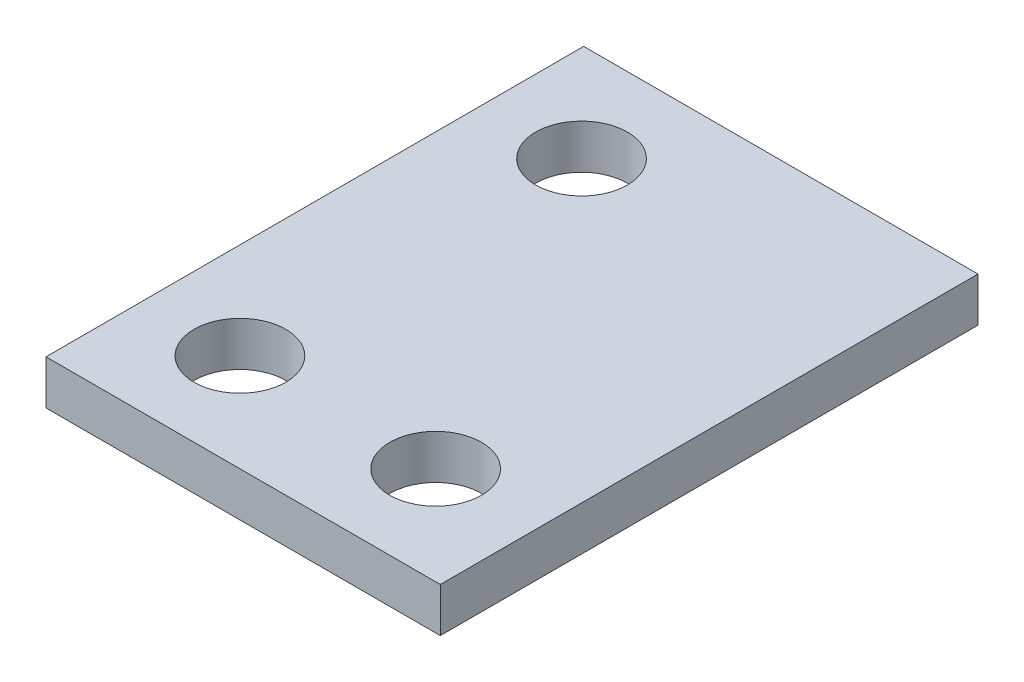
ISO-10303-21;
HEADER;
FILE_DESCRIPTION(('STEP AP214'),'2;1');
FILE_NAME('part.step','',(''),(''),'','','');
FILE_SCHEMA(('AUTOMOTIVE_DESIGN { 1 0 10303 214 1 1 1 1 }'));
ENDSEC;
DATA;
#1=APPLICATION_CONTEXT('core data for automotive mechanical design processes');
#2=APPLICATION_PROTOCOL_DEFINITION('international standard','automotive_design',2000,#1);
#3=PRODUCT_CONTEXT('',#1,'mechanical');
#4=PRODUCT('Part','Part','',(#3));
#5=PRODUCT_RELATED_PRODUCT_CATEGORY('part','',(#4));
#6=PRODUCT_DEFINITION_FORMATION('','',#4);
#7=PRODUCT_DEFINITION_CONTEXT('part definition',#1,'design');
#8=PRODUCT_DEFINITION('design','',#6,#7);
#9=PRODUCT_DEFINITION_SHAPE('','',#8);
#10=(LENGTH_UNIT() NAMED_UNIT(*) SI_UNIT(.MILLI.,.METRE.));
#11=(NAMED_UNIT(*) PLANE_ANGLE_UNIT() SI_UNIT($,.RADIAN.));
#12=(NAMED_UNIT(*) SI_UNIT($,.STERADIAN.) SOLID_ANGLE_UNIT());
#13=UNCERTAINTY_MEASURE_WITH_UNIT(LENGTH_MEASURE(1.E-05),#10,'distance_accuracy_value','');
#14=(GEOMETRIC_REPRESENTATION_CONTEXT(3) GLOBAL_UNCERTAINTY_ASSIGNED_CONTEXT((#13)) GLOBAL_UNIT_ASSIGNED_CONTEXT((#10,
#11,#12)) REPRESENTATION_CONTEXT('',''));
#15=CARTESIAN_POINT('',(0.,0.,0.));
#16=DIRECTION('',(0.,0.,1.));
#17=DIRECTION('',(1.,0.,0.));
#18=AXIS2_PLACEMENT_3D('',#15,#16,#17);
#19=CARTESIAN_POINT('',(6.985,1.57,-9.525));
#20=DIRECTION('',(-1.,0.,0.));
#21=DIRECTION('',(0.,0.,1.));
#22=AXIS2_PLACEMENT_3D('',#19,#20,#21);
#23=PLANE('',#22);
#24=DIRECTION('',(0.,0.,-1.));
#25=VECTOR('',#24,1.);
#26=CARTESIAN_POINT('',(6.985,0.,-9.525));
#27=LINE('',#26,#25);
#28=CARTESIAN_POINT('',(6.985,0.,9.525));
#29=VERTEX_POINT('',#28);
#30=CARTESIAN_POINT('',(6.985,0.,-9.525));
#31=VERTEX_POINT('',#30);
#32=EDGE_CURVE('E102',#29,#31,#27,.T.);
#33=ORIENTED_EDGE('',*,*,#32,.T.);
#34=DIRECTION('',(0.,-1.,0.));
#35=VECTOR('',#34,1.);
#36=CARTESIAN_POINT('',(6.985,1.57,-9.525));
#37=LINE('',#36,#35);
#38=CARTESIAN_POINT('',(6.985,1.57,-9.525));
#39=VERTEX_POINT('',#38);
#40=EDGE_CURVE('E11',#39,#31,#37,.T.);
#41=ORIENTED_EDGE('',*,*,#40,.F.);
#42=DIRECTION('',(0.,0.,-1.));
#43=VECTOR('',#42,1.);
#44=CARTESIAN_POINT('',(6.985,1.57,-9.525));
#45=LINE('',#44,#43);
#46=CARTESIAN_POINT('',(6.985,1.57,9.525));
#47=VERTEX_POINT('',#46);
#48=EDGE_CURVE('E90',#47,#39,#45,.T.);
#49=ORIENTED_EDGE('',*,*,#48,.F.);
#50=DIRECTION('',(0.,-1.,0.));
#51=VECTOR('',#50,1.);
#52=CARTESIAN_POINT('',(6.985,1.57,9.525));
#53=LINE('',#52,#51);
#54=EDGE_CURVE('E98',#47,#29,#53,.T.);
#55=ORIENTED_EDGE('',*,*,#54,.T.);
#56=EDGE_LOOP('',(#33,#41,#49,#55));
#57=FACE_BOUND('',#56,.T.);
#58=ADVANCED_FACE('F39',(#57),#23,.F.);
#59=CARTESIAN_POINT('',(-6.985,1.57,-9.525));
#60=DIRECTION('',(0.,0.,1.));
#61=DIRECTION('',(1.,0.,0.));
#62=AXIS2_PLACEMENT_3D('',#59,#60,#61);
#63=PLANE('',#62);
#64=DIRECTION('',(-1.,0.,0.));
#65=VECTOR('',#64,1.);
#66=CARTESIAN_POINT('',(-6.985,0.,-9.525));
#67=LINE('',#66,#65);
#68=CARTESIAN_POINT('',(-6.985,0.,-9.525));
#69=VERTEX_POINT('',#68);
#70=EDGE_CURVE('E94',#31,#69,#67,.T.);
#71=ORIENTED_EDGE('',*,*,#70,.T.);
#72=DIRECTION('',(0.,-1.,0.));
#73=VECTOR('',#72,1.);
#74=CARTESIAN_POINT('',(-6.985,1.57,-9.525));
#75=LINE('',#74,#73);
#76=CARTESIAN_POINT('',(-6.985,1.57,-9.525));
#77=VERTEX_POINT('',#76);
#78=EDGE_CURVE('E47',#77,#69,#75,.T.);
#79=ORIENTED_EDGE('',*,*,#78,.F.);
#80=DIRECTION('',(-1.,0.,0.));
#81=VECTOR('',#80,1.);
#82=CARTESIAN_POINT('',(-6.985,1.57,-9.525));
#83=LINE('',#82,#81);
#84=EDGE_CURVE('E85',#39,#77,#83,.T.);
#85=ORIENTED_EDGE('',*,*,#84,.F.);
#86=ORIENTED_EDGE('',*,*,#40,.T.);
#87=EDGE_LOOP('',(#71,#79,#85,#86));
#88=FACE_BOUND('',#87,.T.);
#89=ADVANCED_FACE('F93',(#88),#63,.F.);
#90=CARTESIAN_POINT('',(-6.985,1.57,-9.525));
#91=DIRECTION('',(1.,0.,0.));
#92=DIRECTION('',(0.,0.,-1.));
#93=AXIS2_PLACEMENT_3D('',#90,#91,#92);
#94=PLANE('',#93);
#95=DIRECTION('',(0.,0.,1.));
#96=VECTOR('',#95,1.);
#97=CARTESIAN_POINT('',(-6.985,0.,-9.525));
#98=LINE('',#97,#96);
#99=CARTESIAN_POINT('',(-6.985,0.,9.525));
#100=VERTEX_POINT('',#99);
#101=EDGE_CURVE('E72',#69,#100,#98,.T.);
#102=ORIENTED_EDGE('',*,*,#101,.T.);
#103=DIRECTION('',(0.,-1.,0.));
#104=VECTOR('',#103,1.);
#105=CARTESIAN_POINT('',(-6.985,1.57,9.525));
#106=LINE('',#105,#104);
#107=CARTESIAN_POINT('',(-6.985,1.57,9.525));
#108=VERTEX_POINT('',#107);
#109=EDGE_CURVE('E95',#108,#100,#106,.T.);
#110=ORIENTED_EDGE('',*,*,#109,.F.);
#111=DIRECTION('',(0.,0.,1.));
#112=VECTOR('',#111,1.);
#113=CARTESIAN_POINT('',(-6.985,1.57,-9.525));
#114=LINE('',#113,#112);
#115=EDGE_CURVE('E88',#77,#108,#114,.T.);
#116=ORIENTED_EDGE('',*,*,#115,.F.);
#117=ORIENTED_EDGE('',*,*,#78,.T.);
#118=EDGE_LOOP('',(#102,#110,#116,#117));
#119=FACE_BOUND('',#118,.T.);
#120=ADVANCED_FACE('F96',(#119),#94,.F.);
#121=CARTESIAN_POINT('',(-6.985,1.57,9.525));
#122=DIRECTION('',(0.,0.,-1.));
#123=DIRECTION('',(-1.,0.,0.));
#124=AXIS2_PLACEMENT_3D('',#121,#122,#123);
#125=PLANE('',#124);
#126=DIRECTION('',(1.,0.,0.));
#127=VECTOR('',#126,1.);
#128=CARTESIAN_POINT('',(-6.985,0.,9.525));
#129=LINE('',#128,#127);
#130=EDGE_CURVE('E78',#100,#29,#129,.T.);
#131=ORIENTED_EDGE('',*,*,#130,.T.);
#132=ORIENTED_EDGE('',*,*,#54,.F.);
#133=DIRECTION('',(1.,0.,0.));
#134=VECTOR('',#133,1.);
#135=CARTESIAN_POINT('',(-6.985,1.57,9.525));
#136=LINE('',#135,#134);
#137=EDGE_CURVE('E55',#108,#47,#136,.T.);
#138=ORIENTED_EDGE('',*,*,#137,.F.);
#139=ORIENTED_EDGE('',*,*,#109,.T.);
#140=EDGE_LOOP('',(#131,#132,#138,#139));
#141=FACE_BOUND('',#140,.T.);
#142=ADVANCED_FACE('F110',(#141),#125,.F.);
#143=CARTESIAN_POINT('',(0.,1.57,0.));
#144=DIRECTION('',(0.,1.,0.));
#145=DIRECTION('',(0.,0.,1.));
#146=AXIS2_PLACEMENT_3D('',#143,#144,#145);
#147=PLANE('',#146);
#148=CARTESIAN_POINT('',(-3.5814,1.57,-6.0452));
#149=DIRECTION('',(0.,1.,0.));
#150=DIRECTION('',(0.,0.,1.));
#151=AXIS2_PLACEMENT_3D('',#148,#149,#150);
#152=CIRCLE('',#151,1.6256);
#153=CARTESIAN_POINT('',(-3.5814,1.57,-4.4196));
#154=VERTEX_POINT('',#153);
#155=EDGE_CURVE('E122',#154,#154,#152,.T.);
#156=ORIENTED_EDGE('',*,*,#155,.F.);
#157=EDGE_LOOP('',(#156));
#158=FACE_BOUND('',#157,.T.);
#159=CARTESIAN_POINT('',(3.35280000000001,1.57,6.0579));
#160=DIRECTION('',(0.,1.,0.));
#161=DIRECTION('',(0.,0.,1.));
#162=AXIS2_PLACEMENT_3D('',#159,#160,#161);
#163=CIRCLE('',#162,1.6256);
#164=CARTESIAN_POINT('',(3.35280000000001,1.57,7.6835));
#165=VERTEX_POINT('',#164);
#166=EDGE_CURVE('E121',#165,#165,#163,.T.);
#167=ORIENTED_EDGE('',*,*,#166,.F.);
#168=EDGE_LOOP('',(#167));
#169=FACE_BOUND('',#168,.T.);
#170=CARTESIAN_POINT('',(-3.5814,1.57,6.0579));
#171=DIRECTION('',(0.,1.,0.));
#172=DIRECTION('',(0.,0.,1.));
#173=AXIS2_PLACEMENT_3D('',#170,#171,#172);
#174=CIRCLE('',#173,1.6256);
#175=CARTESIAN_POINT('',(-3.5814,1.57,7.6835));
#176=VERTEX_POINT('',#175);
#177=EDGE_CURVE('E118',#176,#176,#174,.T.);
#178=ORIENTED_EDGE('',*,*,#177,.F.);
#179=EDGE_LOOP('',(#178));
#180=FACE_BOUND('',#179,.T.);
#181=ORIENTED_EDGE('',*,*,#48,.T.);
#182=ORIENTED_EDGE('',*,*,#84,.T.);
#183=ORIENTED_EDGE('',*,*,#115,.T.);
#184=ORIENTED_EDGE('',*,*,#137,.T.);
#185=EDGE_LOOP('',(#181,#182,#183,#184));
#186=FACE_BOUND('',#185,.T.);
#187=ADVANCED_FACE('F86',(#158,#169,#180,#186),#147,.T.);
#188=CARTESIAN_POINT('',(0.,0.,0.));
#189=DIRECTION('',(0.,1.,0.));
#190=DIRECTION('',(0.,0.,1.));
#191=AXIS2_PLACEMENT_3D('',#188,#189,#190);
#192=PLANE('',#191);
#193=CARTESIAN_POINT('',(-3.5814,0.,-6.0452));
#194=DIRECTION('',(0.,1.,0.));
#195=DIRECTION('',(0.,0.,1.));
#196=AXIS2_PLACEMENT_3D('',#193,#194,#195);
#197=CIRCLE('',#196,1.6256);
#198=CARTESIAN_POINT('',(-3.5814,0.,-4.4196));
#199=VERTEX_POINT('',#198);
#200=EDGE_CURVE('E126',#199,#199,#197,.F.);
#201=ORIENTED_EDGE('',*,*,#200,.F.);
#202=EDGE_LOOP('',(#201));
#203=FACE_BOUND('',#202,.T.);
#204=CARTESIAN_POINT('',(3.35280000000001,0.,6.0579));
#205=DIRECTION('',(0.,1.,0.));
#206=DIRECTION('',(0.,0.,1.));
#207=AXIS2_PLACEMENT_3D('',#204,#205,#206);
#208=CIRCLE('',#207,1.6256);
#209=CARTESIAN_POINT('',(3.35280000000001,0.,7.6835));
#210=VERTEX_POINT('',#209);
#211=EDGE_CURVE('E125',#210,#210,#208,.F.);
#212=ORIENTED_EDGE('',*,*,#211,.F.);
#213=EDGE_LOOP('',(#212));
#214=FACE_BOUND('',#213,.T.);
#215=CARTESIAN_POINT('',(-3.5814,0.,6.0579));
#216=DIRECTION('',(0.,1.,0.));
#217=DIRECTION('',(0.,0.,1.));
#218=AXIS2_PLACEMENT_3D('',#215,#216,#217);
#219=CIRCLE('',#218,1.6256);
#220=CARTESIAN_POINT('',(-3.5814,0.,7.6835));
#221=VERTEX_POINT('',#220);
#222=EDGE_CURVE('E105',#221,#221,#219,.F.);
#223=ORIENTED_EDGE('',*,*,#222,.F.);
#224=EDGE_LOOP('',(#223));
#225=FACE_BOUND('',#224,.T.);
#226=ORIENTED_EDGE('',*,*,#32,.F.);
#227=ORIENTED_EDGE('',*,*,#130,.F.);
#228=ORIENTED_EDGE('',*,*,#101,.F.);
#229=ORIENTED_EDGE('',*,*,#70,.F.);
#230=EDGE_LOOP('',(#226,#227,#228,#229));
#231=FACE_BOUND('',#230,.T.);
#232=ADVANCED_FACE('F113',(#203,#214,#225,#231),#192,.F.);
#233=CARTESIAN_POINT('',(-3.5814,-0.000999999999999916,6.0579));
#234=DIRECTION('',(0.,1.,0.));
#235=DIRECTION('',(0.,0.,1.));
#236=AXIS2_PLACEMENT_3D('',#233,#234,#235);
#237=CYLINDRICAL_SURFACE('',#236,1.6256);
#238=ORIENTED_EDGE('',*,*,#177,.T.);
#239=EDGE_LOOP('',(#238));
#240=FACE_BOUND('',#239,.T.);
#241=ORIENTED_EDGE('',*,*,#222,.T.);
#242=EDGE_LOOP('',(#241));
#243=FACE_BOUND('',#242,.T.);
#244=ADVANCED_FACE('F138',(#240,#243),#237,.F.);
#245=CARTESIAN_POINT('',(3.35280000000001,-0.000999999999999916,6.0579));
#246=DIRECTION('',(0.,1.,0.));
#247=DIRECTION('',(0.,0.,1.));
#248=AXIS2_PLACEMENT_3D('',#245,#246,#247);
#249=CYLINDRICAL_SURFACE('',#248,1.6256);
#250=ORIENTED_EDGE('',*,*,#166,.T.);
#251=EDGE_LOOP('',(#250));
#252=FACE_BOUND('',#251,.T.);
#253=ORIENTED_EDGE('',*,*,#211,.T.);
#254=EDGE_LOOP('',(#253));
#255=FACE_BOUND('',#254,.T.);
#256=ADVANCED_FACE('F134',(#252,#255),#249,.F.);
#257=CARTESIAN_POINT('',(-3.5814,-0.000999999999999916,-6.0452));
#258=DIRECTION('',(0.,1.,0.));
#259=DIRECTION('',(0.,0.,1.));
#260=AXIS2_PLACEMENT_3D('',#257,#258,#259);
#261=CYLINDRICAL_SURFACE('',#260,1.6256);
#262=ORIENTED_EDGE('',*,*,#155,.T.);
#263=EDGE_LOOP('',(#262));
#264=FACE_BOUND('',#263,.T.);
#265=ORIENTED_EDGE('',*,*,#200,.T.);
#266=EDGE_LOOP('',(#265));
#267=FACE_BOUND('',#266,.T.);
#268=ADVANCED_FACE('F149',(#264,#267),#261,.F.);
#269=CLOSED_SHELL('',(#58,#89,#120,#142,#187,#232,#244,#256,#268));
#270=MANIFOLD_SOLID_BREP('B2',#269);
#271=ADVANCED_BREP_SHAPE_REPRESENTATION('',(#18,#270),#14);
#272=SHAPE_DEFINITION_REPRESENTATION(#9,#271);
ENDSEC;
END-ISO-10303-21;
